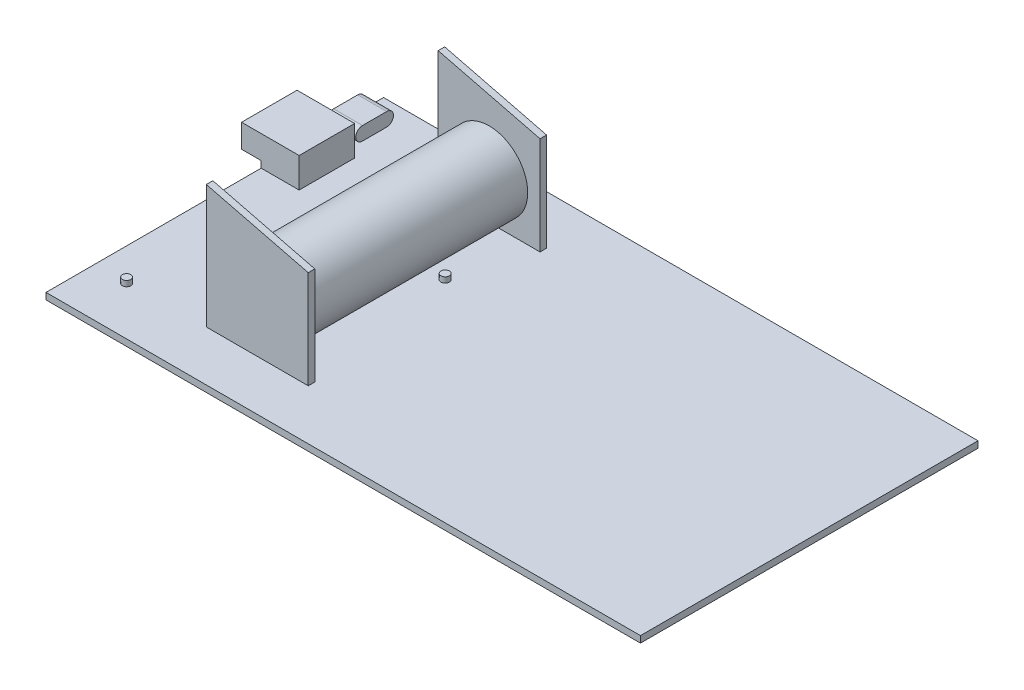
ISO-10303-21;
HEADER;
FILE_DESCRIPTION(('STEP AP214'),'2;1');
FILE_NAME('part.step','',(''),(''),'','','');
FILE_SCHEMA(('AUTOMOTIVE_DESIGN { 1 0 10303 214 1 1 1 1 }'));
ENDSEC;
DATA;
#1=APPLICATION_CONTEXT('core data for automotive mechanical design processes');
#2=APPLICATION_PROTOCOL_DEFINITION('international standard','automotive_design',2000,#1);
#3=PRODUCT_CONTEXT('',#1,'mechanical');
#4=PRODUCT('Part','Part','',(#3));
#5=PRODUCT_RELATED_PRODUCT_CATEGORY('part','',(#4));
#6=PRODUCT_DEFINITION_FORMATION('','',#4);
#7=PRODUCT_DEFINITION_CONTEXT('part definition',#1,'design');
#8=PRODUCT_DEFINITION('design','',#6,#7);
#9=PRODUCT_DEFINITION_SHAPE('','',#8);
#10=(LENGTH_UNIT() NAMED_UNIT(*) SI_UNIT(.MILLI.,.METRE.));
#11=(NAMED_UNIT(*) PLANE_ANGLE_UNIT() SI_UNIT($,.RADIAN.));
#12=(NAMED_UNIT(*) SI_UNIT($,.STERADIAN.) SOLID_ANGLE_UNIT());
#13=UNCERTAINTY_MEASURE_WITH_UNIT(LENGTH_MEASURE(1.E-05),#10,'distance_accuracy_value','');
#14=(GEOMETRIC_REPRESENTATION_CONTEXT(3) GLOBAL_UNCERTAINTY_ASSIGNED_CONTEXT((#13)) GLOBAL_UNIT_ASSIGNED_CONTEXT((#10,
#11,#12)) REPRESENTATION_CONTEXT('',''));
#15=CARTESIAN_POINT('',(0.,0.,0.));
#16=DIRECTION('',(0.,0.,1.));
#17=DIRECTION('',(1.,0.,0.));
#18=AXIS2_PLACEMENT_3D('',#15,#16,#17);
#19=CARTESIAN_POINT('',(0.,1.55,0.));
#20=DIRECTION('',(0.,-1.,0.));
#21=DIRECTION('',(0.,0.,-1.));
#22=AXIS2_PLACEMENT_3D('',#19,#20,#21);
#23=PLANE('',#22);
#24=CARTESIAN_POINT('',(-25.75,1.55,-9.9));
#25=DIRECTION('',(0.,-1.,0.));
#26=DIRECTION('',(0.,0.,-1.));
#27=AXIS2_PLACEMENT_3D('',#24,#25,#26);
#28=CIRCLE('',#27,0.999999999999998);
#29=CARTESIAN_POINT('',(-25.75,1.55,-10.9));
#30=VERTEX_POINT('',#29);
#31=EDGE_CURVE('E11',#30,#30,#28,.F.);
#32=ORIENTED_EDGE('',*,*,#31,.F.);
#33=EDGE_LOOP('',(#32));
#34=FACE_BOUND('',#33,.T.);
#35=CARTESIAN_POINT('',(-62.75,1.55,28.6));
#36=DIRECTION('',(0.,-1.,0.));
#37=DIRECTION('',(0.,0.,-1.));
#38=AXIS2_PLACEMENT_3D('',#35,#36,#37);
#39=CIRCLE('',#38,0.999999999999998);
#40=CARTESIAN_POINT('',(-62.75,1.55,27.6));
#41=VERTEX_POINT('',#40);
#42=EDGE_CURVE('E62',#41,#41,#39,.F.);
#43=ORIENTED_EDGE('',*,*,#42,.F.);
#44=EDGE_LOOP('',(#43));
#45=FACE_BOUND('',#44,.T.);
#46=DIRECTION('',(0.,0.,1.));
#47=VECTOR('',#46,1.);
#48=CARTESIAN_POINT('',(-44.35,1.55,-26.85));
#49=LINE('',#48,#47);
#50=CARTESIAN_POINT('',(-44.35,1.55,-28.4));
#51=VERTEX_POINT('',#50);
#52=CARTESIAN_POINT('',(-44.35,1.55,-26.85));
#53=VERTEX_POINT('',#52);
#54=EDGE_CURVE('E235',#51,#53,#49,.T.);
#55=ORIENTED_EDGE('',*,*,#54,.F.);
#56=DIRECTION('',(-1.,0.,0.));
#57=VECTOR('',#56,1.);
#58=CARTESIAN_POINT('',(-44.35,1.55,-28.4));
#59=LINE('',#58,#57);
#60=CARTESIAN_POINT('',(-20.2,1.55,-28.4));
#61=VERTEX_POINT('',#60);
#62=EDGE_CURVE('E249',#61,#51,#59,.T.);
#63=ORIENTED_EDGE('',*,*,#62,.F.);
#64=DIRECTION('',(0.,0.,-1.));
#65=VECTOR('',#64,1.);
#66=CARTESIAN_POINT('',(-20.2,1.55,-26.85));
#67=LINE('',#66,#65);
#68=CARTESIAN_POINT('',(-20.2,1.55,-26.85));
#69=VERTEX_POINT('',#68);
#70=EDGE_CURVE('E254',#69,#61,#67,.T.);
#71=ORIENTED_EDGE('',*,*,#70,.F.);
#72=DIRECTION('',(1.,0.,0.));
#73=VECTOR('',#72,1.);
#74=CARTESIAN_POINT('',(-44.35,1.55,-26.85));
#75=LINE('',#74,#73);
#76=EDGE_CURVE('E240',#53,#69,#75,.T.);
#77=ORIENTED_EDGE('',*,*,#76,.F.);
#78=EDGE_LOOP('',(#55,#63,#71,#77));
#79=FACE_BOUND('',#78,.T.);
#80=DIRECTION('',(0.,0.,1.));
#81=VECTOR('',#80,1.);
#82=CARTESIAN_POINT('',(-61.45,1.55,0.));
#83=LINE('',#82,#81);
#84=CARTESIAN_POINT('',(-61.45,1.55,-24.15));
#85=VERTEX_POINT('',#84);
#86=CARTESIAN_POINT('',(-61.45,1.55,-11.));
#87=VERTEX_POINT('',#86);
#88=EDGE_CURVE('E322',#85,#87,#83,.T.);
#89=ORIENTED_EDGE('',*,*,#88,.T.);
#90=DIRECTION('',(-1.,0.,0.));
#91=VECTOR('',#90,1.);
#92=CARTESIAN_POINT('',(0.,1.55,-11.));
#93=LINE('',#92,#91);
#94=CARTESIAN_POINT('',(-70.45,1.55,-11.));
#95=VERTEX_POINT('',#94);
#96=EDGE_CURVE('E318',#87,#95,#93,.T.);
#97=ORIENTED_EDGE('',*,*,#96,.T.);
#98=DIRECTION('',(0.,0.,1.));
#99=VECTOR('',#98,1.);
#100=CARTESIAN_POINT('',(-70.45,1.55,40.));
#101=LINE('',#100,#99);
#102=CARTESIAN_POINT('',(-70.45,1.55,40.));
#103=VERTEX_POINT('',#102);
#104=EDGE_CURVE('E376',#95,#103,#101,.T.);
#105=ORIENTED_EDGE('',*,*,#104,.T.);
#106=DIRECTION('',(1.,0.,0.));
#107=VECTOR('',#106,1.);
#108=CARTESIAN_POINT('',(-70.45,1.55,40.));
#109=LINE('',#108,#107);
#110=CARTESIAN_POINT('',(70.45,1.55,40.));
#111=VERTEX_POINT('',#110);
#112=EDGE_CURVE('E381',#103,#111,#109,.T.);
#113=ORIENTED_EDGE('',*,*,#112,.T.);
#114=DIRECTION('',(0.,0.,-1.));
#115=VECTOR('',#114,1.);
#116=CARTESIAN_POINT('',(70.45,1.55,40.));
#117=LINE('',#116,#115);
#118=CARTESIAN_POINT('',(70.45,1.55,-40.));
#119=VERTEX_POINT('',#118);
#120=EDGE_CURVE('E368',#111,#119,#117,.T.);
#121=ORIENTED_EDGE('',*,*,#120,.T.);
#122=DIRECTION('',(-1.,0.,0.));
#123=VECTOR('',#122,1.);
#124=CARTESIAN_POINT('',(-70.45,1.55,-40.));
#125=LINE('',#124,#123);
#126=CARTESIAN_POINT('',(-70.45,1.55,-40.));
#127=VERTEX_POINT('',#126);
#128=EDGE_CURVE('E372',#119,#127,#125,.T.);
#129=ORIENTED_EDGE('',*,*,#128,.T.);
#130=CARTESIAN_POINT('',(-70.45,1.55,-34.3));
#131=VERTEX_POINT('',#130);
#132=EDGE_CURVE('E377',#127,#131,#101,.T.);
#133=ORIENTED_EDGE('',*,*,#132,.T.);
#134=DIRECTION('',(1.,0.,0.));
#135=VECTOR('',#134,1.);
#136=CARTESIAN_POINT('',(-70.85,1.55,-34.3));
#137=LINE('',#136,#135);
#138=CARTESIAN_POINT('',(-64.,1.55,-34.3));
#139=VERTEX_POINT('',#138);
#140=EDGE_CURVE('E415',#139,#131,#137,.F.);
#141=ORIENTED_EDGE('',*,*,#140,.F.);
#142=DIRECTION('',(0.,0.,1.));
#143=VECTOR('',#142,1.);
#144=CARTESIAN_POINT('',(-64.,1.55,-34.3));
#145=LINE('',#144,#143);
#146=CARTESIAN_POINT('',(-64.,1.55,-28.56));
#147=VERTEX_POINT('',#146);
#148=EDGE_CURVE('E329',#139,#147,#145,.T.);
#149=ORIENTED_EDGE('',*,*,#148,.T.);
#150=DIRECTION('',(1.,0.,0.));
#151=VECTOR('',#150,1.);
#152=CARTESIAN_POINT('',(-70.85,1.55,-28.56));
#153=LINE('',#152,#151);
#154=CARTESIAN_POINT('',(-70.45,1.55,-28.56));
#155=VERTEX_POINT('',#154);
#156=EDGE_CURVE('E412',#147,#155,#153,.F.);
#157=ORIENTED_EDGE('',*,*,#156,.T.);
#158=CARTESIAN_POINT('',(-70.45,1.55,-24.15));
#159=VERTEX_POINT('',#158);
#160=EDGE_CURVE('E617',#155,#159,#101,.T.);
#161=ORIENTED_EDGE('',*,*,#160,.T.);
#162=DIRECTION('',(1.,0.,0.));
#163=VECTOR('',#162,1.);
#164=CARTESIAN_POINT('',(0.,1.55,-24.15));
#165=LINE('',#164,#163);
#166=EDGE_CURVE('E307',#159,#85,#165,.T.);
#167=ORIENTED_EDGE('',*,*,#166,.T.);
#168=EDGE_LOOP('',(#89,#97,#105,#113,#121,#129,#133,#141,#149,#157,#161,#167));
#169=FACE_BOUND('',#168,.T.);
#170=DIRECTION('',(0.,0.,1.));
#171=VECTOR('',#170,1.);
#172=CARTESIAN_POINT('',(-44.35,1.55,28.1));
#173=LINE('',#172,#171);
#174=CARTESIAN_POINT('',(-44.35,1.55,26.55));
#175=VERTEX_POINT('',#174);
#176=CARTESIAN_POINT('',(-44.35,1.55,28.1));
#177=VERTEX_POINT('',#176);
#178=EDGE_CURVE('E233',#175,#177,#173,.T.);
#179=ORIENTED_EDGE('',*,*,#178,.F.);
#180=DIRECTION('',(-1.,0.,0.));
#181=VECTOR('',#180,1.);
#182=CARTESIAN_POINT('',(-44.35,1.55,26.55));
#183=LINE('',#182,#181);
#184=CARTESIAN_POINT('',(-20.2,1.55,26.55));
#185=VERTEX_POINT('',#184);
#186=EDGE_CURVE('E222',#185,#175,#183,.T.);
#187=ORIENTED_EDGE('',*,*,#186,.F.);
#188=DIRECTION('',(0.,0.,-1.));
#189=VECTOR('',#188,1.);
#190=CARTESIAN_POINT('',(-20.2,1.55,28.1));
#191=LINE('',#190,#189);
#192=CARTESIAN_POINT('',(-20.2,1.55,28.1));
#193=VERTEX_POINT('',#192);
#194=EDGE_CURVE('E456',#193,#185,#191,.T.);
#195=ORIENTED_EDGE('',*,*,#194,.F.);
#196=DIRECTION('',(1.,0.,0.));
#197=VECTOR('',#196,1.);
#198=CARTESIAN_POINT('',(-44.35,1.55,28.1));
#199=LINE('',#198,#197);
#200=EDGE_CURVE('E69',#177,#193,#199,.T.);
#201=ORIENTED_EDGE('',*,*,#200,.F.);
#202=EDGE_LOOP('',(#179,#187,#195,#201));
#203=FACE_BOUND('',#202,.T.);
#204=ADVANCED_FACE('F53',(#34,#45,#79,#169,#203),#23,.F.);
#205=CARTESIAN_POINT('',(70.45,1.55,40.));
#206=DIRECTION('',(-1.,0.,0.));
#207=DIRECTION('',(0.,0.,1.));
#208=AXIS2_PLACEMENT_3D('',#205,#206,#207);
#209=PLANE('',#208);
#210=DIRECTION('',(0.,0.,-1.));
#211=VECTOR('',#210,1.);
#212=CARTESIAN_POINT('',(70.45,0.,40.));
#213=LINE('',#212,#211);
#214=CARTESIAN_POINT('',(70.45,0.,40.));
#215=VERTEX_POINT('',#214);
#216=CARTESIAN_POINT('',(70.45,0.,-40.));
#217=VERTEX_POINT('',#216);
#218=EDGE_CURVE('E367',#215,#217,#213,.T.);
#219=ORIENTED_EDGE('',*,*,#218,.T.);
#220=DIRECTION('',(0.,-1.,0.));
#221=VECTOR('',#220,1.);
#222=CARTESIAN_POINT('',(70.45,1.55,-40.));
#223=LINE('',#222,#221);
#224=EDGE_CURVE('E408',#119,#217,#223,.T.);
#225=ORIENTED_EDGE('',*,*,#224,.F.);
#226=ORIENTED_EDGE('',*,*,#120,.F.);
#227=DIRECTION('',(0.,-1.,0.));
#228=VECTOR('',#227,1.);
#229=CARTESIAN_POINT('',(70.45,1.55,40.));
#230=LINE('',#229,#228);
#231=EDGE_CURVE('E385',#111,#215,#230,.T.);
#232=ORIENTED_EDGE('',*,*,#231,.T.);
#233=EDGE_LOOP('',(#219,#225,#226,#232));
#234=FACE_BOUND('',#233,.T.);
#235=ADVANCED_FACE('F55',(#234),#209,.F.);
#236=CARTESIAN_POINT('',(-70.45,1.55,-40.));
#237=DIRECTION('',(0.,0.,1.));
#238=DIRECTION('',(1.,0.,0.));
#239=AXIS2_PLACEMENT_3D('',#236,#237,#238);
#240=PLANE('',#239);
#241=DIRECTION('',(-1.,0.,0.));
#242=VECTOR('',#241,1.);
#243=CARTESIAN_POINT('',(-70.45,0.,-40.));
#244=LINE('',#243,#242);
#245=CARTESIAN_POINT('',(-70.45,0.,-40.));
#246=VERTEX_POINT('',#245);
#247=EDGE_CURVE('E389',#217,#246,#244,.T.);
#248=ORIENTED_EDGE('',*,*,#247,.T.);
#249=DIRECTION('',(0.,-1.,0.));
#250=VECTOR('',#249,1.);
#251=CARTESIAN_POINT('',(-70.45,1.55,-40.));
#252=LINE('',#251,#250);
#253=EDGE_CURVE('E404',#127,#246,#252,.T.);
#254=ORIENTED_EDGE('',*,*,#253,.F.);
#255=ORIENTED_EDGE('',*,*,#128,.F.);
#256=ORIENTED_EDGE('',*,*,#224,.T.);
#257=EDGE_LOOP('',(#248,#254,#255,#256));
#258=FACE_BOUND('',#257,.T.);
#259=ADVANCED_FACE('F597',(#258),#240,.F.);
#260=CARTESIAN_POINT('',(-70.45,1.55,40.));
#261=DIRECTION('',(1.,0.,0.));
#262=DIRECTION('',(0.,0.,-1.));
#263=AXIS2_PLACEMENT_3D('',#260,#261,#262);
#264=PLANE('',#263);
#265=DIRECTION('',(0.,-1.,0.));
#266=VECTOR('',#265,1.);
#267=CARTESIAN_POINT('',(-70.45,0.,-24.15));
#268=LINE('',#267,#266);
#269=CARTESIAN_POINT('',(-70.45,3.1,-24.15));
#270=VERTEX_POINT('',#269);
#271=EDGE_CURVE('E422',#270,#159,#268,.T.);
#272=ORIENTED_EDGE('',*,*,#271,.T.);
#273=ORIENTED_EDGE('',*,*,#160,.F.);
#274=EDGE_CURVE('E382',#131,#155,#101,.T.);
#275=ORIENTED_EDGE('',*,*,#274,.F.);
#276=ORIENTED_EDGE('',*,*,#132,.F.);
#277=ORIENTED_EDGE('',*,*,#253,.T.);
#278=DIRECTION('',(0.,0.,1.));
#279=VECTOR('',#278,1.);
#280=CARTESIAN_POINT('',(-70.45,0.,40.));
#281=LINE('',#280,#279);
#282=CARTESIAN_POINT('',(-70.45,0.,40.));
#283=VERTEX_POINT('',#282);
#284=EDGE_CURVE('E392',#246,#283,#281,.T.);
#285=ORIENTED_EDGE('',*,*,#284,.T.);
#286=DIRECTION('',(0.,-1.,0.));
#287=VECTOR('',#286,1.);
#288=CARTESIAN_POINT('',(-70.45,1.55,40.));
#289=LINE('',#288,#287);
#290=EDGE_CURVE('E400',#103,#283,#289,.T.);
#291=ORIENTED_EDGE('',*,*,#290,.F.);
#292=ORIENTED_EDGE('',*,*,#104,.F.);
#293=DIRECTION('',(0.,1.,0.));
#294=VECTOR('',#293,1.);
#295=CARTESIAN_POINT('',(-70.45,0.,-11.));
#296=LINE('',#295,#294);
#297=CARTESIAN_POINT('',(-70.45,3.1,-11.));
#298=VERTEX_POINT('',#297);
#299=EDGE_CURVE('E274',#95,#298,#296,.T.);
#300=ORIENTED_EDGE('',*,*,#299,.T.);
#301=DIRECTION('',(0.,0.,1.));
#302=VECTOR('',#301,1.);
#303=CARTESIAN_POINT('',(-70.45,3.1,-25.1));
#304=LINE('',#303,#302);
#305=EDGE_CURVE('E281',#270,#298,#304,.T.);
#306=ORIENTED_EDGE('',*,*,#305,.F.);
#307=EDGE_LOOP('',(#272,#273,#275,#276,#277,#285,#291,#292,#300,#306));
#308=FACE_BOUND('',#307,.T.);
#309=ADVANCED_FACE('F594',(#308),#264,.F.);
#310=CARTESIAN_POINT('',(-70.45,1.55,40.));
#311=DIRECTION('',(0.,0.,-1.));
#312=DIRECTION('',(-1.,0.,0.));
#313=AXIS2_PLACEMENT_3D('',#310,#311,#312);
#314=PLANE('',#313);
#315=DIRECTION('',(1.,0.,0.));
#316=VECTOR('',#315,1.);
#317=CARTESIAN_POINT('',(-70.45,0.,40.));
#318=LINE('',#317,#316);
#319=EDGE_CURVE('E373',#283,#215,#318,.T.);
#320=ORIENTED_EDGE('',*,*,#319,.T.);
#321=ORIENTED_EDGE('',*,*,#231,.F.);
#322=ORIENTED_EDGE('',*,*,#112,.F.);
#323=ORIENTED_EDGE('',*,*,#290,.T.);
#324=EDGE_LOOP('',(#320,#321,#322,#323));
#325=FACE_BOUND('',#324,.T.);
#326=ADVANCED_FACE('F590',(#325),#314,.F.);
#327=CARTESIAN_POINT('',(0.,0.,0.));
#328=DIRECTION('',(0.,-1.,0.));
#329=DIRECTION('',(0.,0.,-1.));
#330=AXIS2_PLACEMENT_3D('',#327,#328,#329);
#331=PLANE('',#330);
#332=ORIENTED_EDGE('',*,*,#319,.F.);
#333=ORIENTED_EDGE('',*,*,#284,.F.);
#334=ORIENTED_EDGE('',*,*,#247,.F.);
#335=ORIENTED_EDGE('',*,*,#218,.F.);
#336=EDGE_LOOP('',(#332,#333,#334,#335));
#337=FACE_BOUND('',#336,.T.);
#338=ADVANCED_FACE('F583',(#337),#331,.T.);
#339=CARTESIAN_POINT('',(-70.85,1.55,-34.3));
#340=DIRECTION('',(0.,1.,0.));
#341=DIRECTION('',(0.,0.,1.));
#342=AXIS2_PLACEMENT_3D('',#339,#340,#341);
#343=PLANE('',#342);
#344=DIRECTION('',(1.,0.,0.));
#345=VECTOR('',#344,1.);
#346=CARTESIAN_POINT('',(-70.85,1.55,-34.3));
#347=LINE('',#346,#345);
#348=CARTESIAN_POINT('',(-70.85,1.55,-34.3));
#349=VERTEX_POINT('',#348);
#350=EDGE_CURVE('E363',#349,#131,#347,.T.);
#351=ORIENTED_EDGE('',*,*,#350,.T.);
#352=ORIENTED_EDGE('',*,*,#274,.T.);
#353=DIRECTION('',(1.,0.,0.));
#354=VECTOR('',#353,1.);
#355=CARTESIAN_POINT('',(-70.85,1.55,-28.56));
#356=LINE('',#355,#354);
#357=CARTESIAN_POINT('',(-70.85,1.55,-28.56));
#358=VERTEX_POINT('',#357);
#359=EDGE_CURVE('E359',#358,#155,#356,.T.);
#360=ORIENTED_EDGE('',*,*,#359,.F.);
#361=DIRECTION('',(0.,0.,1.));
#362=VECTOR('',#361,1.);
#363=CARTESIAN_POINT('',(-70.85,1.55,-34.3));
#364=LINE('',#363,#362);
#365=EDGE_CURVE('E344',#349,#358,#364,.T.);
#366=ORIENTED_EDGE('',*,*,#365,.F.);
#367=EDGE_LOOP('',(#351,#352,#360,#366));
#368=FACE_BOUND('',#367,.T.);
#369=ADVANCED_FACE('F580',(#368),#343,.F.);
#370=CARTESIAN_POINT('',(-70.85,3.15,-34.3));
#371=DIRECTION('',(1.,0.,0.));
#372=DIRECTION('',(0.,0.,-1.));
#373=AXIS2_PLACEMENT_3D('',#370,#371,#372);
#374=CYLINDRICAL_SURFACE('',#373,1.6);
#375=DIRECTION('',(1.,0.,0.));
#376=VECTOR('',#375,1.);
#377=CARTESIAN_POINT('',(-70.85,4.75,-34.3));
#378=LINE('',#377,#376);
#379=CARTESIAN_POINT('',(-70.85,4.75,-34.3));
#380=VERTEX_POINT('',#379);
#381=CARTESIAN_POINT('',(-64.,4.75,-34.3));
#382=VERTEX_POINT('',#381);
#383=EDGE_CURVE('E353',#380,#382,#378,.T.);
#384=ORIENTED_EDGE('',*,*,#383,.T.);
#385=CARTESIAN_POINT('',(-64.,3.15,-34.3));
#386=DIRECTION('',(-1.,0.,0.));
#387=DIRECTION('',(0.,0.,1.));
#388=AXIS2_PLACEMENT_3D('',#385,#386,#387);
#389=CIRCLE('',#388,1.6);
#390=EDGE_CURVE('E325',#382,#139,#389,.T.);
#391=ORIENTED_EDGE('',*,*,#390,.T.);
#392=ORIENTED_EDGE('',*,*,#140,.T.);
#393=ORIENTED_EDGE('',*,*,#350,.F.);
#394=CARTESIAN_POINT('',(-70.85,3.15,-34.3));
#395=DIRECTION('',(-1.,0.,0.));
#396=DIRECTION('',(0.,0.,1.));
#397=AXIS2_PLACEMENT_3D('',#394,#395,#396);
#398=CIRCLE('',#397,1.6);
#399=EDGE_CURVE('E340',#380,#349,#398,.T.);
#400=ORIENTED_EDGE('',*,*,#399,.F.);
#401=EDGE_LOOP('',(#384,#391,#392,#393,#400));
#402=FACE_BOUND('',#401,.T.);
#403=ADVANCED_FACE('F578',(#402),#374,.T.);
#404=CARTESIAN_POINT('',(-70.85,3.15,-28.56));
#405=DIRECTION('',(1.,0.,0.));
#406=DIRECTION('',(0.,0.,-1.));
#407=AXIS2_PLACEMENT_3D('',#404,#405,#406);
#408=CYLINDRICAL_SURFACE('',#407,1.6);
#409=ORIENTED_EDGE('',*,*,#359,.T.);
#410=ORIENTED_EDGE('',*,*,#156,.F.);
#411=CARTESIAN_POINT('',(-64.,3.15,-28.56));
#412=DIRECTION('',(-1.,0.,0.));
#413=DIRECTION('',(0.,0.,1.));
#414=AXIS2_PLACEMENT_3D('',#411,#412,#413);
#415=CIRCLE('',#414,1.6);
#416=CARTESIAN_POINT('',(-64.,4.75,-28.56));
#417=VERTEX_POINT('',#416);
#418=EDGE_CURVE('E332',#147,#417,#415,.T.);
#419=ORIENTED_EDGE('',*,*,#418,.T.);
#420=DIRECTION('',(1.,0.,0.));
#421=VECTOR('',#420,1.);
#422=CARTESIAN_POINT('',(-70.85,4.75,-28.56));
#423=LINE('',#422,#421);
#424=CARTESIAN_POINT('',(-70.85,4.75,-28.56));
#425=VERTEX_POINT('',#424);
#426=EDGE_CURVE('E356',#425,#417,#423,.T.);
#427=ORIENTED_EDGE('',*,*,#426,.F.);
#428=CARTESIAN_POINT('',(-70.85,3.15,-28.56));
#429=DIRECTION('',(-1.,0.,0.));
#430=DIRECTION('',(0.,0.,1.));
#431=AXIS2_PLACEMENT_3D('',#428,#429,#430);
#432=CIRCLE('',#431,1.6);
#433=EDGE_CURVE('E347',#358,#425,#432,.T.);
#434=ORIENTED_EDGE('',*,*,#433,.F.);
#435=EDGE_LOOP('',(#409,#410,#419,#427,#434));
#436=FACE_BOUND('',#435,.T.);
#437=ADVANCED_FACE('F574',(#436),#408,.T.);
#438=CARTESIAN_POINT('',(-70.85,4.75,-34.3));
#439=DIRECTION('',(0.,-1.,0.));
#440=DIRECTION('',(0.,0.,-1.));
#441=AXIS2_PLACEMENT_3D('',#438,#439,#440);
#442=PLANE('',#441);
#443=ORIENTED_EDGE('',*,*,#426,.T.);
#444=DIRECTION('',(0.,0.,-1.));
#445=VECTOR('',#444,1.);
#446=CARTESIAN_POINT('',(-64.,4.75,-34.3));
#447=LINE('',#446,#445);
#448=EDGE_CURVE('E336',#417,#382,#447,.T.);
#449=ORIENTED_EDGE('',*,*,#448,.T.);
#450=ORIENTED_EDGE('',*,*,#383,.F.);
#451=DIRECTION('',(0.,0.,-1.));
#452=VECTOR('',#451,1.);
#453=CARTESIAN_POINT('',(-70.85,4.75,-34.3));
#454=LINE('',#453,#452);
#455=EDGE_CURVE('E350',#425,#380,#454,.T.);
#456=ORIENTED_EDGE('',*,*,#455,.F.);
#457=EDGE_LOOP('',(#443,#449,#450,#456));
#458=FACE_BOUND('',#457,.T.);
#459=ADVANCED_FACE('F570',(#458),#442,.F.);
#460=CARTESIAN_POINT('',(-70.85,3.15,-34.3));
#461=DIRECTION('',(-1.,0.,0.));
#462=DIRECTION('',(0.,0.,1.));
#463=AXIS2_PLACEMENT_3D('',#460,#461,#462);
#464=PLANE('',#463);
#465=ORIENTED_EDGE('',*,*,#399,.T.);
#466=ORIENTED_EDGE('',*,*,#365,.T.);
#467=ORIENTED_EDGE('',*,*,#433,.T.);
#468=ORIENTED_EDGE('',*,*,#455,.T.);
#469=EDGE_LOOP('',(#465,#466,#467,#468));
#470=FACE_BOUND('',#469,.T.);
#471=ADVANCED_FACE('F566',(#470),#464,.T.);
#472=CARTESIAN_POINT('',(-64.,3.15,-34.3));
#473=DIRECTION('',(-1.,0.,0.));
#474=DIRECTION('',(0.,0.,1.));
#475=AXIS2_PLACEMENT_3D('',#472,#473,#474);
#476=PLANE('',#475);
#477=ORIENTED_EDGE('',*,*,#390,.F.);
#478=ORIENTED_EDGE('',*,*,#448,.F.);
#479=ORIENTED_EDGE('',*,*,#418,.F.);
#480=ORIENTED_EDGE('',*,*,#148,.F.);
#481=EDGE_LOOP('',(#477,#478,#479,#480));
#482=FACE_BOUND('',#481,.T.);
#483=ADVANCED_FACE('F562',(#482),#476,.F.);
#484=CARTESIAN_POINT('',(-61.45,0.,-11.));
#485=DIRECTION('',(1.,0.,0.));
#486=DIRECTION('',(0.,0.,-1.));
#487=AXIS2_PLACEMENT_3D('',#484,#485,#486);
#488=PLANE('',#487);
#489=ORIENTED_EDGE('',*,*,#88,.F.);
#490=DIRECTION('',(0.,1.,0.));
#491=VECTOR('',#490,1.);
#492=CARTESIAN_POINT('',(-61.45,0.,-24.15));
#493=LINE('',#492,#491);
#494=CARTESIAN_POINT('',(-61.45,8.65,-24.15));
#495=VERTEX_POINT('',#494);
#496=EDGE_CURVE('E303',#85,#495,#493,.T.);
#497=ORIENTED_EDGE('',*,*,#496,.T.);
#498=DIRECTION('',(0.,0.,-1.));
#499=VECTOR('',#498,1.);
#500=CARTESIAN_POINT('',(-61.45,8.65,-11.));
#501=LINE('',#500,#499);
#502=CARTESIAN_POINT('',(-61.45,8.65,-11.));
#503=VERTEX_POINT('',#502);
#504=EDGE_CURVE('E287',#503,#495,#501,.T.);
#505=ORIENTED_EDGE('',*,*,#504,.F.);
#506=DIRECTION('',(0.,1.,0.));
#507=VECTOR('',#506,1.);
#508=CARTESIAN_POINT('',(-61.45,0.,-11.));
#509=LINE('',#508,#507);
#510=EDGE_CURVE('E304',#87,#503,#509,.T.);
#511=ORIENTED_EDGE('',*,*,#510,.F.);
#512=EDGE_LOOP('',(#489,#497,#505,#511));
#513=FACE_BOUND('',#512,.T.);
#514=ADVANCED_FACE('F552',(#513),#488,.T.);
#515=CARTESIAN_POINT('',(-61.45,0.,-11.));
#516=DIRECTION('',(0.,0.,1.));
#517=DIRECTION('',(1.,0.,0.));
#518=AXIS2_PLACEMENT_3D('',#515,#516,#517);
#519=PLANE('',#518);
#520=ORIENTED_EDGE('',*,*,#299,.F.);
#521=ORIENTED_EDGE('',*,*,#96,.F.);
#522=ORIENTED_EDGE('',*,*,#510,.T.);
#523=DIRECTION('',(1.,0.,0.));
#524=VECTOR('',#523,1.);
#525=CARTESIAN_POINT('',(-61.45,8.65,-11.));
#526=LINE('',#525,#524);
#527=CARTESIAN_POINT('',(-75.1,8.65,-11.));
#528=VERTEX_POINT('',#527);
#529=EDGE_CURVE('E299',#528,#503,#526,.T.);
#530=ORIENTED_EDGE('',*,*,#529,.F.);
#531=DIRECTION('',(0.,1.,0.));
#532=VECTOR('',#531,1.);
#533=CARTESIAN_POINT('',(-75.1,0.,-11.));
#534=LINE('',#533,#532);
#535=CARTESIAN_POINT('',(-75.1,3.1,-11.));
#536=VERTEX_POINT('',#535);
#537=EDGE_CURVE('E308',#536,#528,#534,.T.);
#538=ORIENTED_EDGE('',*,*,#537,.F.);
#539=DIRECTION('',(-1.,0.,0.));
#540=VECTOR('',#539,1.);
#541=CARTESIAN_POINT('',(-70.45,3.1,-11.));
#542=LINE('',#541,#540);
#543=EDGE_CURVE('E278',#298,#536,#542,.T.);
#544=ORIENTED_EDGE('',*,*,#543,.F.);
#545=EDGE_LOOP('',(#520,#521,#522,#530,#538,#544));
#546=FACE_BOUND('',#545,.T.);
#547=ADVANCED_FACE('F548',(#546),#519,.T.);
#548=CARTESIAN_POINT('',(-61.45,0.,-24.15));
#549=DIRECTION('',(0.,0.,-1.));
#550=DIRECTION('',(-1.,0.,0.));
#551=AXIS2_PLACEMENT_3D('',#548,#549,#550);
#552=PLANE('',#551);
#553=ORIENTED_EDGE('',*,*,#271,.F.);
#554=DIRECTION('',(1.,0.,0.));
#555=VECTOR('',#554,1.);
#556=CARTESIAN_POINT('',(-61.45,3.1,-24.15));
#557=LINE('',#556,#555);
#558=CARTESIAN_POINT('',(-75.1,3.1,-24.15));
#559=VERTEX_POINT('',#558);
#560=EDGE_CURVE('E284',#559,#270,#557,.T.);
#561=ORIENTED_EDGE('',*,*,#560,.F.);
#562=DIRECTION('',(0.,1.,0.));
#563=VECTOR('',#562,1.);
#564=CARTESIAN_POINT('',(-75.1,0.,-24.15));
#565=LINE('',#564,#563);
#566=CARTESIAN_POINT('',(-75.1,8.65,-24.15));
#567=VERTEX_POINT('',#566);
#568=EDGE_CURVE('E311',#559,#567,#565,.T.);
#569=ORIENTED_EDGE('',*,*,#568,.T.);
#570=DIRECTION('',(-1.,0.,0.));
#571=VECTOR('',#570,1.);
#572=CARTESIAN_POINT('',(-61.45,8.65,-24.15));
#573=LINE('',#572,#571);
#574=EDGE_CURVE('E291',#495,#567,#573,.T.);
#575=ORIENTED_EDGE('',*,*,#574,.F.);
#576=ORIENTED_EDGE('',*,*,#496,.F.);
#577=ORIENTED_EDGE('',*,*,#166,.F.);
#578=EDGE_LOOP('',(#553,#561,#569,#575,#576,#577));
#579=FACE_BOUND('',#578,.T.);
#580=ADVANCED_FACE('F551',(#579),#552,.T.);
#581=CARTESIAN_POINT('',(-75.1,0.,-11.));
#582=DIRECTION('',(-1.,0.,0.));
#583=DIRECTION('',(0.,0.,1.));
#584=AXIS2_PLACEMENT_3D('',#581,#582,#583);
#585=PLANE('',#584);
#586=DIRECTION('',(0.,0.,-1.));
#587=VECTOR('',#586,1.);
#588=CARTESIAN_POINT('',(-75.1,3.1,-11.));
#589=LINE('',#588,#587);
#590=EDGE_CURVE('E419',#536,#559,#589,.T.);
#591=ORIENTED_EDGE('',*,*,#590,.F.);
#592=ORIENTED_EDGE('',*,*,#537,.T.);
#593=DIRECTION('',(0.,0.,1.));
#594=VECTOR('',#593,1.);
#595=CARTESIAN_POINT('',(-75.1,8.65,-11.));
#596=LINE('',#595,#594);
#597=EDGE_CURVE('E295',#567,#528,#596,.T.);
#598=ORIENTED_EDGE('',*,*,#597,.F.);
#599=ORIENTED_EDGE('',*,*,#568,.F.);
#600=EDGE_LOOP('',(#591,#592,#598,#599));
#601=FACE_BOUND('',#600,.T.);
#602=ADVANCED_FACE('F546',(#601),#585,.T.);
#603=CARTESIAN_POINT('',(0.,8.65,0.));
#604=DIRECTION('',(0.,1.,0.));
#605=DIRECTION('',(0.,0.,1.));
#606=AXIS2_PLACEMENT_3D('',#603,#604,#605);
#607=PLANE('',#606);
#608=ORIENTED_EDGE('',*,*,#504,.T.);
#609=ORIENTED_EDGE('',*,*,#574,.T.);
#610=ORIENTED_EDGE('',*,*,#597,.T.);
#611=ORIENTED_EDGE('',*,*,#529,.T.);
#612=EDGE_LOOP('',(#608,#609,#610,#611));
#613=FACE_BOUND('',#612,.T.);
#614=ADVANCED_FACE('F542',(#613),#607,.T.);
#615=CARTESIAN_POINT('',(-70.45,3.1,-25.1));
#616=DIRECTION('',(0.,1.,0.));
#617=DIRECTION('',(-1.,0.,0.));
#618=AXIS2_PLACEMENT_3D('',#615,#616,#617);
#619=PLANE('',#618);
#620=ORIENTED_EDGE('',*,*,#560,.T.);
#621=ORIENTED_EDGE('',*,*,#305,.T.);
#622=ORIENTED_EDGE('',*,*,#543,.T.);
#623=ORIENTED_EDGE('',*,*,#590,.T.);
#624=EDGE_LOOP('',(#620,#621,#622,#623));
#625=FACE_BOUND('',#624,.T.);
#626=ADVANCED_FACE('F538',(#625),#619,.F.);
#627=CARTESIAN_POINT('',(-44.35,30.8,-26.85));
#628=DIRECTION('',(1.,0.,0.));
#629=DIRECTION('',(0.,0.,-1.));
#630=AXIS2_PLACEMENT_3D('',#627,#628,#629);
#631=PLANE('',#630);
#632=ORIENTED_EDGE('',*,*,#54,.T.);
#633=DIRECTION('',(0.,-1.,0.));
#634=VECTOR('',#633,1.);
#635=CARTESIAN_POINT('',(-44.35,30.8,-26.85));
#636=LINE('',#635,#634);
#637=CARTESIAN_POINT('',(-44.35,30.8,-26.85));
#638=VERTEX_POINT('',#637);
#639=EDGE_CURVE('E270',#638,#53,#636,.T.);
#640=ORIENTED_EDGE('',*,*,#639,.F.);
#641=DIRECTION('',(0.,0.,1.));
#642=VECTOR('',#641,1.);
#643=CARTESIAN_POINT('',(-44.35,30.8,-26.85));
#644=LINE('',#643,#642);
#645=CARTESIAN_POINT('',(-44.35,30.8,-28.4));
#646=VERTEX_POINT('',#645);
#647=EDGE_CURVE('E246',#646,#638,#644,.T.);
#648=ORIENTED_EDGE('',*,*,#647,.F.);
#649=DIRECTION('',(0.,-1.,0.));
#650=VECTOR('',#649,1.);
#651=CARTESIAN_POINT('',(-44.35,30.8,-28.4));
#652=LINE('',#651,#650);
#653=EDGE_CURVE('E248',#646,#51,#652,.T.);
#654=ORIENTED_EDGE('',*,*,#653,.T.);
#655=EDGE_LOOP('',(#632,#640,#648,#654));
#656=FACE_BOUND('',#655,.T.);
#657=ADVANCED_FACE('F534',(#656),#631,.F.);
#658=CARTESIAN_POINT('',(-44.35,30.8,-26.85));
#659=DIRECTION('',(0.,0.,-1.));
#660=DIRECTION('',(-1.,0.,0.));
#661=AXIS2_PLACEMENT_3D('',#658,#659,#660);
#662=PLANE('',#661);
#663=CARTESIAN_POINT('',(-32.275,12.25,-26.85));
#664=DIRECTION('',(0.,0.,-1.));
#665=DIRECTION('',(-1.,0.,0.));
#666=AXIS2_PLACEMENT_3D('',#663,#664,#665);
#667=CIRCLE('',#666,9.15);
#668=CARTESIAN_POINT('',(-41.425,12.25,-26.85));
#669=VERTEX_POINT('',#668);
#670=EDGE_CURVE('E430',#669,#669,#667,.F.);
#671=ORIENTED_EDGE('',*,*,#670,.F.);
#672=EDGE_LOOP('',(#671));
#673=FACE_BOUND('',#672,.T.);
#674=DIRECTION('',(0.,-1.,0.));
#675=VECTOR('',#674,1.);
#676=CARTESIAN_POINT('',(-20.2,30.8,-26.85));
#677=LINE('',#676,#675);
#678=CARTESIAN_POINT('',(-20.2,24.7787287313374,-26.85));
#679=VERTEX_POINT('',#678);
#680=EDGE_CURVE('E267',#679,#69,#677,.T.);
#681=ORIENTED_EDGE('',*,*,#680,.F.);
#682=DIRECTION('',(-0.970295726275998,0.241921895599661,0.));
#683=VECTOR('',#682,1.);
#684=CARTESIAN_POINT('',(-44.35,30.8,-26.85));
#685=LINE('',#684,#683);
#686=EDGE_CURVE('E450',#679,#638,#685,.T.);
#687=ORIENTED_EDGE('',*,*,#686,.T.);
#688=ORIENTED_EDGE('',*,*,#639,.T.);
#689=ORIENTED_EDGE('',*,*,#76,.T.);
#690=EDGE_LOOP('',(#681,#687,#688,#689));
#691=FACE_BOUND('',#690,.T.);
#692=ADVANCED_FACE('F530',(#673,#691),#662,.F.);
#693=CARTESIAN_POINT('',(-20.2,30.8,-26.85));
#694=DIRECTION('',(-1.,0.,0.));
#695=DIRECTION('',(0.,0.,1.));
#696=AXIS2_PLACEMENT_3D('',#693,#694,#695);
#697=PLANE('',#696);
#698=DIRECTION('',(0.,-1.,0.));
#699=VECTOR('',#698,1.);
#700=CARTESIAN_POINT('',(-20.2,30.8,-28.4));
#701=LINE('',#700,#699);
#702=CARTESIAN_POINT('',(-20.2,24.7787287313374,-28.4));
#703=VERTEX_POINT('',#702);
#704=EDGE_CURVE('E264',#703,#61,#701,.T.);
#705=ORIENTED_EDGE('',*,*,#704,.F.);
#706=DIRECTION('',(0.,0.,1.));
#707=VECTOR('',#706,1.);
#708=CARTESIAN_POINT('',(-20.2,24.7787287313374,-60.9));
#709=LINE('',#708,#707);
#710=EDGE_CURVE('E475',#703,#679,#709,.T.);
#711=ORIENTED_EDGE('',*,*,#710,.T.);
#712=ORIENTED_EDGE('',*,*,#680,.T.);
#713=ORIENTED_EDGE('',*,*,#70,.T.);
#714=EDGE_LOOP('',(#705,#711,#712,#713));
#715=FACE_BOUND('',#714,.T.);
#716=ADVANCED_FACE('F526',(#715),#697,.F.);
#717=CARTESIAN_POINT('',(-44.35,30.8,-28.4));
#718=DIRECTION('',(0.,0.,1.));
#719=DIRECTION('',(1.,0.,0.));
#720=AXIS2_PLACEMENT_3D('',#717,#718,#719);
#721=PLANE('',#720);
#722=ORIENTED_EDGE('',*,*,#653,.F.);
#723=DIRECTION('',(0.970295726275998,-0.241921895599661,0.));
#724=VECTOR('',#723,1.);
#725=CARTESIAN_POINT('',(-44.35,30.8,-28.4));
#726=LINE('',#725,#724);
#727=EDGE_CURVE('E469',#646,#703,#726,.T.);
#728=ORIENTED_EDGE('',*,*,#727,.T.);
#729=ORIENTED_EDGE('',*,*,#704,.T.);
#730=ORIENTED_EDGE('',*,*,#62,.T.);
#731=EDGE_LOOP('',(#722,#728,#729,#730));
#732=FACE_BOUND('',#731,.T.);
#733=ADVANCED_FACE('F523',(#732),#721,.F.);
#734=CARTESIAN_POINT('',(-44.35,30.8,28.1));
#735=DIRECTION('',(1.,0.,0.));
#736=DIRECTION('',(0.,0.,-1.));
#737=AXIS2_PLACEMENT_3D('',#734,#735,#736);
#738=PLANE('',#737);
#739=ORIENTED_EDGE('',*,*,#178,.T.);
#740=DIRECTION('',(0.,-1.,0.));
#741=VECTOR('',#740,1.);
#742=CARTESIAN_POINT('',(-44.35,30.8,28.1));
#743=LINE('',#742,#741);
#744=CARTESIAN_POINT('',(-44.35,30.8,28.1));
#745=VERTEX_POINT('',#744);
#746=EDGE_CURVE('E226',#745,#177,#743,.T.);
#747=ORIENTED_EDGE('',*,*,#746,.F.);
#748=DIRECTION('',(0.,0.,1.));
#749=VECTOR('',#748,1.);
#750=CARTESIAN_POINT('',(-44.35,30.8,28.1));
#751=LINE('',#750,#749);
#752=CARTESIAN_POINT('',(-44.35,30.8,26.55));
#753=VERTEX_POINT('',#752);
#754=EDGE_CURVE('E210',#753,#745,#751,.T.);
#755=ORIENTED_EDGE('',*,*,#754,.F.);
#756=DIRECTION('',(0.,-1.,0.));
#757=VECTOR('',#756,1.);
#758=CARTESIAN_POINT('',(-44.35,30.8,26.55));
#759=LINE('',#758,#757);
#760=EDGE_CURVE('E221',#753,#175,#759,.T.);
#761=ORIENTED_EDGE('',*,*,#760,.T.);
#762=EDGE_LOOP('',(#739,#747,#755,#761));
#763=FACE_BOUND('',#762,.T.);
#764=ADVANCED_FACE('F232',(#763),#738,.F.);
#765=CARTESIAN_POINT('',(-44.35,30.8,28.1));
#766=DIRECTION('',(0.,0.,-1.));
#767=DIRECTION('',(-1.,0.,0.));
#768=AXIS2_PLACEMENT_3D('',#765,#766,#767);
#769=PLANE('',#768);
#770=DIRECTION('',(0.,-1.,0.));
#771=VECTOR('',#770,1.);
#772=CARTESIAN_POINT('',(-20.2,30.8,28.1));
#773=LINE('',#772,#771);
#774=CARTESIAN_POINT('',(-20.2,24.7787287313374,28.1));
#775=VERTEX_POINT('',#774);
#776=EDGE_CURVE('E77',#775,#193,#773,.T.);
#777=ORIENTED_EDGE('',*,*,#776,.F.);
#778=DIRECTION('',(0.970295726275998,-0.241921895599661,0.));
#779=VECTOR('',#778,1.);
#780=CARTESIAN_POINT('',(-44.35,30.8,28.1));
#781=LINE('',#780,#779);
#782=EDGE_CURVE('E213',#745,#775,#781,.T.);
#783=ORIENTED_EDGE('',*,*,#782,.F.);
#784=ORIENTED_EDGE('',*,*,#746,.T.);
#785=ORIENTED_EDGE('',*,*,#200,.T.);
#786=EDGE_LOOP('',(#777,#783,#784,#785));
#787=FACE_BOUND('',#786,.T.);
#788=ADVANCED_FACE('F225',(#787),#769,.F.);
#789=CARTESIAN_POINT('',(-20.2,30.8,28.1));
#790=DIRECTION('',(-1.,0.,0.));
#791=DIRECTION('',(0.,0.,1.));
#792=AXIS2_PLACEMENT_3D('',#789,#790,#791);
#793=PLANE('',#792);
#794=DIRECTION('',(0.,-1.,0.));
#795=VECTOR('',#794,1.);
#796=CARTESIAN_POINT('',(-20.2,30.8,26.55));
#797=LINE('',#796,#795);
#798=CARTESIAN_POINT('',(-20.2,24.7787287313374,26.55));
#799=VERTEX_POINT('',#798);
#800=EDGE_CURVE('E242',#799,#185,#797,.T.);
#801=ORIENTED_EDGE('',*,*,#800,.F.);
#802=EDGE_CURVE('E229',#799,#775,#709,.T.);
#803=ORIENTED_EDGE('',*,*,#802,.T.);
#804=ORIENTED_EDGE('',*,*,#776,.T.);
#805=ORIENTED_EDGE('',*,*,#194,.T.);
#806=EDGE_LOOP('',(#801,#803,#804,#805));
#807=FACE_BOUND('',#806,.T.);
#808=ADVANCED_FACE('F515',(#807),#793,.F.);
#809=CARTESIAN_POINT('',(-44.35,30.8,26.55));
#810=DIRECTION('',(0.,0.,1.));
#811=DIRECTION('',(1.,0.,0.));
#812=AXIS2_PLACEMENT_3D('',#809,#810,#811);
#813=PLANE('',#812);
#814=CARTESIAN_POINT('',(-32.275,12.25,26.55));
#815=DIRECTION('',(0.,0.,1.));
#816=DIRECTION('',(1.,0.,0.));
#817=AXIS2_PLACEMENT_3D('',#814,#815,#816);
#818=CIRCLE('',#817,9.15);
#819=CARTESIAN_POINT('',(-23.125,12.25,26.55));
#820=VERTEX_POINT('',#819);
#821=EDGE_CURVE('E426',#820,#820,#818,.F.);
#822=ORIENTED_EDGE('',*,*,#821,.F.);
#823=EDGE_LOOP('',(#822));
#824=FACE_BOUND('',#823,.T.);
#825=ORIENTED_EDGE('',*,*,#760,.F.);
#826=DIRECTION('',(0.970295726275998,-0.241921895599661,0.));
#827=VECTOR('',#826,1.);
#828=CARTESIAN_POINT('',(-44.35,30.8,26.55));
#829=LINE('',#828,#827);
#830=EDGE_CURVE('E215',#753,#799,#829,.T.);
#831=ORIENTED_EDGE('',*,*,#830,.T.);
#832=ORIENTED_EDGE('',*,*,#800,.T.);
#833=ORIENTED_EDGE('',*,*,#186,.T.);
#834=EDGE_LOOP('',(#825,#831,#832,#833));
#835=FACE_BOUND('',#834,.T.);
#836=ADVANCED_FACE('F453',(#824,#835),#813,.F.);
#837=CARTESIAN_POINT('',(-44.35,30.8,-60.9));
#838=DIRECTION('',(-0.241921895599661,-0.970295726275998,0.));
#839=DIRECTION('',(0.970295726275998,-0.241921895599661,0.));
#840=AXIS2_PLACEMENT_3D('',#837,#838,#839);
#841=PLANE('',#840);
#842=ORIENTED_EDGE('',*,*,#754,.T.);
#843=ORIENTED_EDGE('',*,*,#782,.T.);
#844=ORIENTED_EDGE('',*,*,#802,.F.);
#845=ORIENTED_EDGE('',*,*,#830,.F.);
#846=EDGE_LOOP('',(#842,#843,#844,#845));
#847=FACE_BOUND('',#846,.T.);
#848=ADVANCED_FACE('F212',(#847),#841,.F.);
#849=ORIENTED_EDGE('',*,*,#710,.F.);
#850=ORIENTED_EDGE('',*,*,#727,.F.);
#851=ORIENTED_EDGE('',*,*,#647,.T.);
#852=ORIENTED_EDGE('',*,*,#686,.F.);
#853=EDGE_LOOP('',(#849,#850,#851,#852));
#854=FACE_BOUND('',#853,.T.);
#855=ADVANCED_FACE('F508',(#854),#841,.F.);
#856=CARTESIAN_POINT('',(-32.275,12.25,27.15));
#857=DIRECTION('',(0.,0.,-1.));
#858=DIRECTION('',(-1.,0.,0.));
#859=AXIS2_PLACEMENT_3D('',#856,#857,#858);
#860=CYLINDRICAL_SURFACE('',#859,9.15);
#861=ORIENTED_EDGE('',*,*,#670,.T.);
#862=EDGE_LOOP('',(#861));
#863=FACE_BOUND('',#862,.T.);
#864=ORIENTED_EDGE('',*,*,#821,.T.);
#865=EDGE_LOOP('',(#864));
#866=FACE_BOUND('',#865,.T.);
#867=ADVANCED_FACE('F504',(#863,#866),#860,.T.);
#868=CARTESIAN_POINT('',(-62.75,2.85,28.6));
#869=DIRECTION('',(0.,-1.,0.));
#870=DIRECTION('',(0.,0.,-1.));
#871=AXIS2_PLACEMENT_3D('',#868,#869,#870);
#872=CYLINDRICAL_SURFACE('',#871,0.999999999999998);
#873=CARTESIAN_POINT('',(-62.75,2.85,28.6));
#874=DIRECTION('',(0.,1.,0.));
#875=DIRECTION('',(0.,0.,1.));
#876=AXIS2_PLACEMENT_3D('',#873,#874,#875);
#877=CIRCLE('',#876,0.999999999999998);
#878=CARTESIAN_POINT('',(-62.75,2.85,29.6));
#879=VERTEX_POINT('',#878);
#880=EDGE_CURVE('E230',#879,#879,#877,.T.);
#881=ORIENTED_EDGE('',*,*,#880,.F.);
#882=EDGE_LOOP('',(#881));
#883=FACE_BOUND('',#882,.T.);
#884=ORIENTED_EDGE('',*,*,#42,.T.);
#885=EDGE_LOOP('',(#884));
#886=FACE_BOUND('',#885,.T.);
#887=ADVANCED_FACE('F437',(#883,#886),#872,.T.);
#888=CARTESIAN_POINT('',(-62.75,2.85,28.6));
#889=DIRECTION('',(0.,1.,0.));
#890=DIRECTION('',(0.,0.,1.));
#891=AXIS2_PLACEMENT_3D('',#888,#889,#890);
#892=PLANE('',#891);
#893=ORIENTED_EDGE('',*,*,#880,.T.);
#894=EDGE_LOOP('',(#893));
#895=FACE_BOUND('',#894,.T.);
#896=ADVANCED_FACE('F491',(#895),#892,.T.);
#897=CARTESIAN_POINT('',(-25.75,2.85,-9.9));
#898=DIRECTION('',(0.,-1.,0.));
#899=DIRECTION('',(0.,0.,-1.));
#900=AXIS2_PLACEMENT_3D('',#897,#898,#899);
#901=CYLINDRICAL_SURFACE('',#900,0.999999999999998);
#902=CARTESIAN_POINT('',(-25.75,2.85,-9.9));
#903=DIRECTION('',(0.,1.,0.));
#904=DIRECTION('',(0.,0.,1.));
#905=AXIS2_PLACEMENT_3D('',#902,#903,#904);
#906=CIRCLE('',#905,0.999999999999998);
#907=CARTESIAN_POINT('',(-25.75,2.85,-8.9));
#908=VERTEX_POINT('',#907);
#909=EDGE_CURVE('E481',#908,#908,#906,.T.);
#910=ORIENTED_EDGE('',*,*,#909,.F.);
#911=EDGE_LOOP('',(#910));
#912=FACE_BOUND('',#911,.T.);
#913=ORIENTED_EDGE('',*,*,#31,.T.);
#914=EDGE_LOOP('',(#913));
#915=FACE_BOUND('',#914,.T.);
#916=ADVANCED_FACE('F488',(#912,#915),#901,.T.);
#917=CARTESIAN_POINT('',(-25.75,2.85,-9.9));
#918=DIRECTION('',(0.,1.,0.));
#919=DIRECTION('',(0.,0.,1.));
#920=AXIS2_PLACEMENT_3D('',#917,#918,#919);
#921=PLANE('',#920);
#922=ORIENTED_EDGE('',*,*,#909,.T.);
#923=EDGE_LOOP('',(#922));
#924=FACE_BOUND('',#923,.T.);
#925=ADVANCED_FACE('F486',(#924),#921,.T.);
#926=CLOSED_SHELL('',(#204,#235,#259,#309,#326,#338,#369,#403,#437,#459,#471,#483,#514,#547,
#580,#602,#614,#626,#657,#692,#716,#733,#764,#788,#808,#836,#848,#855,#867,#887,#896,#916,#925));
#927=MANIFOLD_SOLID_BREP('B2',#926);
#928=ADVANCED_BREP_SHAPE_REPRESENTATION('',(#18,#927),#14);
#929=SHAPE_DEFINITION_REPRESENTATION(#9,#928);
ENDSEC;
END-ISO-10303-21;
